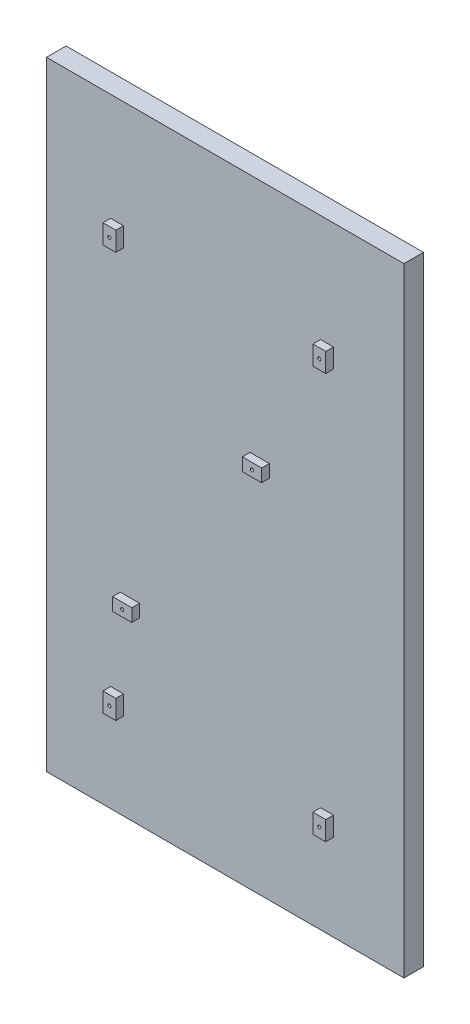
ISO-10303-21;
HEADER;
FILE_DESCRIPTION(('STEP AP214'),'2;1');
FILE_NAME('part.step','',(''),(''),'','','');
FILE_SCHEMA(('AUTOMOTIVE_DESIGN { 1 0 10303 214 1 1 1 1 }'));
ENDSEC;
DATA;
#1=APPLICATION_CONTEXT('core data for automotive mechanical design processes');
#2=APPLICATION_PROTOCOL_DEFINITION('international standard','automotive_design',2000,#1);
#3=PRODUCT_CONTEXT('',#1,'mechanical');
#4=PRODUCT('Part','Part','',(#3));
#5=PRODUCT_RELATED_PRODUCT_CATEGORY('part','',(#4));
#6=PRODUCT_DEFINITION_FORMATION('','',#4);
#7=PRODUCT_DEFINITION_CONTEXT('part definition',#1,'design');
#8=PRODUCT_DEFINITION('design','',#6,#7);
#9=PRODUCT_DEFINITION_SHAPE('','',#8);
#10=(LENGTH_UNIT() NAMED_UNIT(*) SI_UNIT(.MILLI.,.METRE.));
#11=(NAMED_UNIT(*) PLANE_ANGLE_UNIT() SI_UNIT($,.RADIAN.));
#12=(NAMED_UNIT(*) SI_UNIT($,.STERADIAN.) SOLID_ANGLE_UNIT());
#13=UNCERTAINTY_MEASURE_WITH_UNIT(LENGTH_MEASURE(1.E-05),#10,'distance_accuracy_value','');
#14=(GEOMETRIC_REPRESENTATION_CONTEXT(3) GLOBAL_UNCERTAINTY_ASSIGNED_CONTEXT((#13)) GLOBAL_UNIT_ASSIGNED_CONTEXT((#10,
#11,#12)) REPRESENTATION_CONTEXT('',''));
#15=CARTESIAN_POINT('',(0.,0.,0.));
#16=DIRECTION('',(0.,0.,1.));
#17=DIRECTION('',(1.,0.,0.));
#18=AXIS2_PLACEMENT_3D('',#15,#16,#17);
#19=CARTESIAN_POINT('',(111.5,0.,6.1));
#20=DIRECTION('',(0.,1.,0.));
#21=DIRECTION('',(0.,0.,1.));
#22=AXIS2_PLACEMENT_3D('',#19,#20,#21);
#23=PLANE('',#22);
#24=DIRECTION('',(1.,0.,0.));
#25=VECTOR('',#24,1.);
#26=CARTESIAN_POINT('',(111.5,0.,0.));
#27=LINE('',#26,#25);
#28=CARTESIAN_POINT('',(0.,0.,0.));
#29=VERTEX_POINT('',#28);
#30=CARTESIAN_POINT('',(111.5,0.,0.));
#31=VERTEX_POINT('',#30);
#32=EDGE_CURVE('E438',#29,#31,#27,.T.);
#33=ORIENTED_EDGE('',*,*,#32,.T.);
#34=DIRECTION('',(0.,0.,-1.));
#35=VECTOR('',#34,1.);
#36=CARTESIAN_POINT('',(111.5,0.,6.1));
#37=LINE('',#36,#35);
#38=CARTESIAN_POINT('',(111.5,0.,6.1));
#39=VERTEX_POINT('',#38);
#40=EDGE_CURVE('E11',#39,#31,#37,.T.);
#41=ORIENTED_EDGE('',*,*,#40,.F.);
#42=DIRECTION('',(1.,0.,0.));
#43=VECTOR('',#42,1.);
#44=CARTESIAN_POINT('',(111.5,0.,6.1));
#45=LINE('',#44,#43);
#46=CARTESIAN_POINT('',(0.,0.,6.1));
#47=VERTEX_POINT('',#46);
#48=EDGE_CURVE('E439',#47,#39,#45,.T.);
#49=ORIENTED_EDGE('',*,*,#48,.F.);
#50=DIRECTION('',(0.,0.,-1.));
#51=VECTOR('',#50,1.);
#52=CARTESIAN_POINT('',(0.,0.,6.1));
#53=LINE('',#52,#51);
#54=EDGE_CURVE('E449',#47,#29,#53,.T.);
#55=ORIENTED_EDGE('',*,*,#54,.T.);
#56=EDGE_LOOP('',(#33,#41,#49,#55));
#57=FACE_BOUND('',#56,.T.);
#58=ADVANCED_FACE('F33',(#57),#23,.F.);
#59=CARTESIAN_POINT('',(111.5,193.,6.1));
#60=DIRECTION('',(-1.,0.,0.));
#61=DIRECTION('',(0.,0.,1.));
#62=AXIS2_PLACEMENT_3D('',#59,#60,#61);
#63=PLANE('',#62);
#64=DIRECTION('',(0.,1.,0.));
#65=VECTOR('',#64,1.);
#66=CARTESIAN_POINT('',(111.5,193.,0.));
#67=LINE('',#66,#65);
#68=CARTESIAN_POINT('',(111.5,193.,0.));
#69=VERTEX_POINT('',#68);
#70=EDGE_CURVE('E452',#31,#69,#67,.T.);
#71=ORIENTED_EDGE('',*,*,#70,.T.);
#72=DIRECTION('',(0.,0.,-1.));
#73=VECTOR('',#72,1.);
#74=CARTESIAN_POINT('',(111.5,193.,6.1));
#75=LINE('',#74,#73);
#76=CARTESIAN_POINT('',(111.5,193.,6.1));
#77=VERTEX_POINT('',#76);
#78=EDGE_CURVE('E40',#77,#69,#75,.T.);
#79=ORIENTED_EDGE('',*,*,#78,.F.);
#80=DIRECTION('',(0.,1.,0.));
#81=VECTOR('',#80,1.);
#82=CARTESIAN_POINT('',(111.5,193.,6.1));
#83=LINE('',#82,#81);
#84=EDGE_CURVE('E442',#39,#77,#83,.T.);
#85=ORIENTED_EDGE('',*,*,#84,.F.);
#86=ORIENTED_EDGE('',*,*,#40,.T.);
#87=EDGE_LOOP('',(#71,#79,#85,#86));
#88=FACE_BOUND('',#87,.T.);
#89=ADVANCED_FACE('F482',(#88),#63,.F.);
#90=CARTESIAN_POINT('',(0.,193.,6.1));
#91=DIRECTION('',(0.,-1.,0.));
#92=DIRECTION('',(0.,0.,-1.));
#93=AXIS2_PLACEMENT_3D('',#90,#91,#92);
#94=PLANE('',#93);
#95=DIRECTION('',(-1.,0.,0.));
#96=VECTOR('',#95,1.);
#97=CARTESIAN_POINT('',(0.,193.,0.));
#98=LINE('',#97,#96);
#99=CARTESIAN_POINT('',(0.,193.,0.));
#100=VERTEX_POINT('',#99);
#101=EDGE_CURVE('E454',#69,#100,#98,.T.);
#102=ORIENTED_EDGE('',*,*,#101,.T.);
#103=DIRECTION('',(0.,0.,-1.));
#104=VECTOR('',#103,1.);
#105=CARTESIAN_POINT('',(0.,193.,6.1));
#106=LINE('',#105,#104);
#107=CARTESIAN_POINT('',(0.,193.,6.1));
#108=VERTEX_POINT('',#107);
#109=EDGE_CURVE('E459',#108,#100,#106,.T.);
#110=ORIENTED_EDGE('',*,*,#109,.F.);
#111=DIRECTION('',(-1.,0.,0.));
#112=VECTOR('',#111,1.);
#113=CARTESIAN_POINT('',(0.,193.,6.1));
#114=LINE('',#113,#112);
#115=EDGE_CURVE('E445',#77,#108,#114,.T.);
#116=ORIENTED_EDGE('',*,*,#115,.F.);
#117=ORIENTED_EDGE('',*,*,#78,.T.);
#118=EDGE_LOOP('',(#102,#110,#116,#117));
#119=FACE_BOUND('',#118,.T.);
#120=ADVANCED_FACE('F466',(#119),#94,.F.);
#121=CARTESIAN_POINT('',(0.,0.,6.1));
#122=DIRECTION('',(1.,0.,0.));
#123=DIRECTION('',(0.,0.,-1.));
#124=AXIS2_PLACEMENT_3D('',#121,#122,#123);
#125=PLANE('',#124);
#126=DIRECTION('',(0.,-1.,0.));
#127=VECTOR('',#126,1.);
#128=CARTESIAN_POINT('',(0.,0.,0.));
#129=LINE('',#128,#127);
#130=EDGE_CURVE('E443',#100,#29,#129,.T.);
#131=ORIENTED_EDGE('',*,*,#130,.T.);
#132=ORIENTED_EDGE('',*,*,#54,.F.);
#133=DIRECTION('',(0.,-1.,0.));
#134=VECTOR('',#133,1.);
#135=CARTESIAN_POINT('',(0.,0.,6.1));
#136=LINE('',#135,#134);
#137=EDGE_CURVE('E447',#108,#47,#136,.T.);
#138=ORIENTED_EDGE('',*,*,#137,.F.);
#139=ORIENTED_EDGE('',*,*,#109,.T.);
#140=EDGE_LOOP('',(#131,#132,#138,#139));
#141=FACE_BOUND('',#140,.T.);
#142=ADVANCED_FACE('F475',(#141),#125,.F.);
#143=CARTESIAN_POINT('',(0.,0.,6.1));
#144=DIRECTION('',(0.,0.,-1.));
#145=DIRECTION('',(-1.,0.,0.));
#146=AXIS2_PLACEMENT_3D('',#143,#144,#145);
#147=PLANE('',#146);
#148=DIRECTION('',(0.,-1.,0.));
#149=VECTOR('',#148,1.);
#150=CARTESIAN_POINT('',(23.,60.,6.1));
#151=LINE('',#150,#149);
#152=CARTESIAN_POINT('',(23.,60.,6.1));
#153=VERTEX_POINT('',#152);
#154=CARTESIAN_POINT('',(23.,56.,6.1));
#155=VERTEX_POINT('',#154);
#156=EDGE_CURVE('E238',#153,#155,#151,.T.);
#157=ORIENTED_EDGE('',*,*,#156,.F.);
#158=DIRECTION('',(-1.,0.,0.));
#159=VECTOR('',#158,1.);
#160=CARTESIAN_POINT('',(23.,60.,6.1));
#161=LINE('',#160,#159);
#162=CARTESIAN_POINT('',(29.,60.,6.1));
#163=VERTEX_POINT('',#162);
#164=EDGE_CURVE('E235',#163,#153,#161,.T.);
#165=ORIENTED_EDGE('',*,*,#164,.F.);
#166=DIRECTION('',(0.,1.,0.));
#167=VECTOR('',#166,1.);
#168=CARTESIAN_POINT('',(29.,60.,6.1));
#169=LINE('',#168,#167);
#170=CARTESIAN_POINT('',(29.,56.,6.1));
#171=VERTEX_POINT('',#170);
#172=EDGE_CURVE('E52',#171,#163,#169,.T.);
#173=ORIENTED_EDGE('',*,*,#172,.F.);
#174=DIRECTION('',(1.,0.,0.));
#175=VECTOR('',#174,1.);
#176=CARTESIAN_POINT('',(23.,56.,6.1));
#177=LINE('',#176,#175);
#178=EDGE_CURVE('E47',#155,#171,#177,.T.);
#179=ORIENTED_EDGE('',*,*,#178,.F.);
#180=EDGE_LOOP('',(#157,#165,#173,#179));
#181=FACE_BOUND('',#180,.T.);
#182=DIRECTION('',(0.,-1.,0.));
#183=VECTOR('',#182,1.);
#184=CARTESIAN_POINT('',(63.5,118.,6.1));
#185=LINE('',#184,#183);
#186=CARTESIAN_POINT('',(63.5,118.,6.1));
#187=VERTEX_POINT('',#186);
#188=CARTESIAN_POINT('',(63.5,114.,6.1));
#189=VERTEX_POINT('',#188);
#190=EDGE_CURVE('E249',#187,#189,#185,.T.);
#191=ORIENTED_EDGE('',*,*,#190,.F.);
#192=DIRECTION('',(-1.,0.,0.));
#193=VECTOR('',#192,1.);
#194=CARTESIAN_POINT('',(63.5,118.,6.1));
#195=LINE('',#194,#193);
#196=CARTESIAN_POINT('',(69.5,118.,6.1));
#197=VERTEX_POINT('',#196);
#198=EDGE_CURVE('E255',#197,#187,#195,.T.);
#199=ORIENTED_EDGE('',*,*,#198,.F.);
#200=DIRECTION('',(0.,1.,0.));
#201=VECTOR('',#200,1.);
#202=CARTESIAN_POINT('',(69.5,118.,6.1));
#203=LINE('',#202,#201);
#204=CARTESIAN_POINT('',(69.5,114.,6.1));
#205=VERTEX_POINT('',#204);
#206=EDGE_CURVE('E267',#205,#197,#203,.T.);
#207=ORIENTED_EDGE('',*,*,#206,.F.);
#208=DIRECTION('',(1.,0.,0.));
#209=VECTOR('',#208,1.);
#210=CARTESIAN_POINT('',(63.5,114.,6.1));
#211=LINE('',#210,#209);
#212=EDGE_CURVE('E264',#189,#205,#211,.T.);
#213=ORIENTED_EDGE('',*,*,#212,.F.);
#214=EDGE_LOOP('',(#191,#199,#207,#213));
#215=FACE_BOUND('',#214,.T.);
#216=DIRECTION('',(0.,-1.,0.));
#217=VECTOR('',#216,1.);
#218=CARTESIAN_POINT('',(85.5,159.5,6.1));
#219=LINE('',#218,#217);
#220=CARTESIAN_POINT('',(85.5,159.5,6.1));
#221=VERTEX_POINT('',#220);
#222=CARTESIAN_POINT('',(85.5,153.5,6.1));
#223=VERTEX_POINT('',#222);
#224=EDGE_CURVE('E287',#221,#223,#219,.T.);
#225=ORIENTED_EDGE('',*,*,#224,.F.);
#226=DIRECTION('',(-1.,0.,0.));
#227=VECTOR('',#226,1.);
#228=CARTESIAN_POINT('',(85.5,159.5,6.1));
#229=LINE('',#228,#227);
#230=CARTESIAN_POINT('',(89.5,159.5,6.1));
#231=VERTEX_POINT('',#230);
#232=EDGE_CURVE('E294',#231,#221,#229,.T.);
#233=ORIENTED_EDGE('',*,*,#232,.F.);
#234=DIRECTION('',(0.,1.,0.));
#235=VECTOR('',#234,1.);
#236=CARTESIAN_POINT('',(89.5,159.5,6.1));
#237=LINE('',#236,#235);
#238=CARTESIAN_POINT('',(89.5,153.5,6.1));
#239=VERTEX_POINT('',#238);
#240=EDGE_CURVE('E306',#239,#231,#237,.T.);
#241=ORIENTED_EDGE('',*,*,#240,.F.);
#242=DIRECTION('',(1.,0.,0.));
#243=VECTOR('',#242,1.);
#244=CARTESIAN_POINT('',(85.5,153.5,6.1));
#245=LINE('',#244,#243);
#246=EDGE_CURVE('E303',#223,#239,#245,.T.);
#247=ORIENTED_EDGE('',*,*,#246,.F.);
#248=EDGE_LOOP('',(#225,#233,#241,#247));
#249=FACE_BOUND('',#248,.T.);
#250=DIRECTION('',(0.,-1.,0.));
#251=VECTOR('',#250,1.);
#252=CARTESIAN_POINT('',(20.,159.5,6.1));
#253=LINE('',#252,#251);
#254=CARTESIAN_POINT('',(20.,159.5,6.1));
#255=VERTEX_POINT('',#254);
#256=CARTESIAN_POINT('',(20.,153.5,6.1));
#257=VERTEX_POINT('',#256);
#258=EDGE_CURVE('E326',#255,#257,#253,.T.);
#259=ORIENTED_EDGE('',*,*,#258,.F.);
#260=DIRECTION('',(-1.,0.,0.));
#261=VECTOR('',#260,1.);
#262=CARTESIAN_POINT('',(20.,159.5,6.1));
#263=LINE('',#262,#261);
#264=CARTESIAN_POINT('',(24.,159.5,6.1));
#265=VERTEX_POINT('',#264);
#266=EDGE_CURVE('E333',#265,#255,#263,.T.);
#267=ORIENTED_EDGE('',*,*,#266,.F.);
#268=DIRECTION('',(0.,1.,0.));
#269=VECTOR('',#268,1.);
#270=CARTESIAN_POINT('',(24.,159.5,6.1));
#271=LINE('',#270,#269);
#272=CARTESIAN_POINT('',(24.,153.5,6.1));
#273=VERTEX_POINT('',#272);
#274=EDGE_CURVE('E345',#273,#265,#271,.T.);
#275=ORIENTED_EDGE('',*,*,#274,.F.);
#276=DIRECTION('',(1.,0.,0.));
#277=VECTOR('',#276,1.);
#278=CARTESIAN_POINT('',(20.,153.5,6.1));
#279=LINE('',#278,#277);
#280=EDGE_CURVE('E342',#257,#273,#279,.T.);
#281=ORIENTED_EDGE('',*,*,#280,.F.);
#282=EDGE_LOOP('',(#259,#267,#275,#281));
#283=FACE_BOUND('',#282,.T.);
#284=DIRECTION('',(0.,-1.,0.));
#285=VECTOR('',#284,1.);
#286=CARTESIAN_POINT('',(20.,33.,6.1));
#287=LINE('',#286,#285);
#288=CARTESIAN_POINT('',(20.,33.,6.1));
#289=VERTEX_POINT('',#288);
#290=CARTESIAN_POINT('',(20.,27.,6.1));
#291=VERTEX_POINT('',#290);
#292=EDGE_CURVE('E365',#289,#291,#287,.T.);
#293=ORIENTED_EDGE('',*,*,#292,.F.);
#294=DIRECTION('',(-1.,0.,0.));
#295=VECTOR('',#294,1.);
#296=CARTESIAN_POINT('',(20.,33.,6.1));
#297=LINE('',#296,#295);
#298=CARTESIAN_POINT('',(24.,33.,6.1));
#299=VERTEX_POINT('',#298);
#300=EDGE_CURVE('E372',#299,#289,#297,.T.);
#301=ORIENTED_EDGE('',*,*,#300,.F.);
#302=DIRECTION('',(0.,1.,0.));
#303=VECTOR('',#302,1.);
#304=CARTESIAN_POINT('',(24.,33.,6.1));
#305=LINE('',#304,#303);
#306=CARTESIAN_POINT('',(24.,27.,6.1));
#307=VERTEX_POINT('',#306);
#308=EDGE_CURVE('E384',#307,#299,#305,.T.);
#309=ORIENTED_EDGE('',*,*,#308,.F.);
#310=DIRECTION('',(1.,0.,0.));
#311=VECTOR('',#310,1.);
#312=CARTESIAN_POINT('',(20.,27.,6.1));
#313=LINE('',#312,#311);
#314=EDGE_CURVE('E381',#291,#307,#313,.T.);
#315=ORIENTED_EDGE('',*,*,#314,.F.);
#316=EDGE_LOOP('',(#293,#301,#309,#315));
#317=FACE_BOUND('',#316,.T.);
#318=DIRECTION('',(-1.,0.,0.));
#319=VECTOR('',#318,1.);
#320=CARTESIAN_POINT('',(87.5,33.,6.1));
#321=LINE('',#320,#319);
#322=CARTESIAN_POINT('',(89.5,33.,6.1));
#323=VERTEX_POINT('',#322);
#324=CARTESIAN_POINT('',(85.5,33.,6.1));
#325=VERTEX_POINT('',#324);
#326=EDGE_CURVE('E404',#323,#325,#321,.T.);
#327=ORIENTED_EDGE('',*,*,#326,.F.);
#328=DIRECTION('',(0.,1.,0.));
#329=VECTOR('',#328,1.);
#330=CARTESIAN_POINT('',(89.5,27.,6.1));
#331=LINE('',#330,#329);
#332=CARTESIAN_POINT('',(89.5,27.,6.1));
#333=VERTEX_POINT('',#332);
#334=EDGE_CURVE('E410',#333,#323,#331,.T.);
#335=ORIENTED_EDGE('',*,*,#334,.F.);
#336=DIRECTION('',(1.,0.,0.));
#337=VECTOR('',#336,1.);
#338=CARTESIAN_POINT('',(85.5,27.,6.1));
#339=LINE('',#338,#337);
#340=CARTESIAN_POINT('',(85.5,27.,6.1));
#341=VERTEX_POINT('',#340);
#342=EDGE_CURVE('E422',#341,#333,#339,.T.);
#343=ORIENTED_EDGE('',*,*,#342,.F.);
#344=DIRECTION('',(0.,-1.,0.));
#345=VECTOR('',#344,1.);
#346=CARTESIAN_POINT('',(85.5,33.,6.1));
#347=LINE('',#346,#345);
#348=EDGE_CURVE('E419',#325,#341,#347,.T.);
#349=ORIENTED_EDGE('',*,*,#348,.F.);
#350=EDGE_LOOP('',(#327,#335,#343,#349));
#351=FACE_BOUND('',#350,.T.);
#352=ORIENTED_EDGE('',*,*,#48,.T.);
#353=ORIENTED_EDGE('',*,*,#84,.T.);
#354=ORIENTED_EDGE('',*,*,#115,.T.);
#355=ORIENTED_EDGE('',*,*,#137,.T.);
#356=EDGE_LOOP('',(#352,#353,#354,#355));
#357=FACE_BOUND('',#356,.T.);
#358=ADVANCED_FACE('F481',(#181,#215,#249,#283,#317,#351,#357),#147,.F.);
#359=CARTESIAN_POINT('',(0.,0.,0.));
#360=DIRECTION('',(0.,0.,-1.));
#361=DIRECTION('',(-1.,0.,0.));
#362=AXIS2_PLACEMENT_3D('',#359,#360,#361);
#363=PLANE('',#362);
#364=ORIENTED_EDGE('',*,*,#32,.F.);
#365=ORIENTED_EDGE('',*,*,#130,.F.);
#366=ORIENTED_EDGE('',*,*,#101,.F.);
#367=ORIENTED_EDGE('',*,*,#70,.F.);
#368=EDGE_LOOP('',(#364,#365,#366,#367));
#369=FACE_BOUND('',#368,.T.);
#370=ADVANCED_FACE('F472',(#369),#363,.T.);
#371=CARTESIAN_POINT('',(0.,0.,8.5));
#372=DIRECTION('',(0.,0.,1.));
#373=DIRECTION('',(1.,0.,0.));
#374=AXIS2_PLACEMENT_3D('',#371,#372,#373);
#375=PLANE('',#374);
#376=DIRECTION('',(-1.,0.,0.));
#377=VECTOR('',#376,1.);
#378=CARTESIAN_POINT('',(89.5,33.,8.5));
#379=LINE('',#378,#377);
#380=CARTESIAN_POINT('',(89.5,33.,8.5));
#381=VERTEX_POINT('',#380);
#382=CARTESIAN_POINT('',(85.5,33.,8.5));
#383=VERTEX_POINT('',#382);
#384=EDGE_CURVE('E407',#381,#383,#379,.T.);
#385=ORIENTED_EDGE('',*,*,#384,.T.);
#386=DIRECTION('',(0.,-1.,0.));
#387=VECTOR('',#386,1.);
#388=CARTESIAN_POINT('',(85.5,33.,8.5));
#389=LINE('',#388,#387);
#390=CARTESIAN_POINT('',(85.5,27.,8.5));
#391=VERTEX_POINT('',#390);
#392=EDGE_CURVE('E409',#383,#391,#389,.T.);
#393=ORIENTED_EDGE('',*,*,#392,.T.);
#394=DIRECTION('',(1.,0.,0.));
#395=VECTOR('',#394,1.);
#396=CARTESIAN_POINT('',(85.5,27.,8.5));
#397=LINE('',#396,#395);
#398=CARTESIAN_POINT('',(89.5,27.,8.5));
#399=VERTEX_POINT('',#398);
#400=EDGE_CURVE('E412',#391,#399,#397,.T.);
#401=ORIENTED_EDGE('',*,*,#400,.T.);
#402=DIRECTION('',(0.,1.,0.));
#403=VECTOR('',#402,1.);
#404=CARTESIAN_POINT('',(89.5,27.,8.5));
#405=LINE('',#404,#403);
#406=EDGE_CURVE('E414',#399,#381,#405,.T.);
#407=ORIENTED_EDGE('',*,*,#406,.T.);
#408=EDGE_LOOP('',(#385,#393,#401,#407));
#409=FACE_BOUND('',#408,.T.);
#410=CARTESIAN_POINT('',(87.5,30.,8.5));
#411=DIRECTION('',(0.,0.,1.));
#412=DIRECTION('',(1.,0.,0.));
#413=AXIS2_PLACEMENT_3D('',#410,#411,#412);
#414=CIRCLE('',#413,0.499999999999999);
#415=CARTESIAN_POINT('',(88.,30.,8.5));
#416=VERTEX_POINT('',#415);
#417=EDGE_CURVE('E401',#416,#416,#414,.T.);
#418=ORIENTED_EDGE('',*,*,#417,.F.);
#419=EDGE_LOOP('',(#418));
#420=FACE_BOUND('',#419,.T.);
#421=ADVANCED_FACE('F494',(#409,#420),#375,.T.);
#422=CARTESIAN_POINT('',(87.5,33.,8.5));
#423=DIRECTION('',(0.,-1.,0.));
#424=DIRECTION('',(0.,0.,-1.));
#425=AXIS2_PLACEMENT_3D('',#422,#423,#424);
#426=PLANE('',#425);
#427=ORIENTED_EDGE('',*,*,#326,.T.);
#428=DIRECTION('',(0.,0.,-1.));
#429=VECTOR('',#428,1.);
#430=CARTESIAN_POINT('',(85.5,33.,8.5));
#431=LINE('',#430,#429);
#432=EDGE_CURVE('E435',#383,#325,#431,.T.);
#433=ORIENTED_EDGE('',*,*,#432,.F.);
#434=ORIENTED_EDGE('',*,*,#384,.F.);
#435=DIRECTION('',(0.,0.,-1.));
#436=VECTOR('',#435,1.);
#437=CARTESIAN_POINT('',(89.5,33.,8.5));
#438=LINE('',#437,#436);
#439=EDGE_CURVE('E416',#381,#323,#438,.T.);
#440=ORIENTED_EDGE('',*,*,#439,.T.);
#441=EDGE_LOOP('',(#427,#433,#434,#440));
#442=FACE_BOUND('',#441,.T.);
#443=ADVANCED_FACE('F499',(#442),#426,.F.);
#444=CARTESIAN_POINT('',(85.5,33.,8.5));
#445=DIRECTION('',(1.,0.,0.));
#446=DIRECTION('',(0.,0.,-1.));
#447=AXIS2_PLACEMENT_3D('',#444,#445,#446);
#448=PLANE('',#447);
#449=ORIENTED_EDGE('',*,*,#348,.T.);
#450=DIRECTION('',(0.,0.,-1.));
#451=VECTOR('',#450,1.);
#452=CARTESIAN_POINT('',(85.5,27.,8.5));
#453=LINE('',#452,#451);
#454=EDGE_CURVE('E432',#391,#341,#453,.T.);
#455=ORIENTED_EDGE('',*,*,#454,.F.);
#456=ORIENTED_EDGE('',*,*,#392,.F.);
#457=ORIENTED_EDGE('',*,*,#432,.T.);
#458=EDGE_LOOP('',(#449,#455,#456,#457));
#459=FACE_BOUND('',#458,.T.);
#460=ADVANCED_FACE('F502',(#459),#448,.F.);
#461=CARTESIAN_POINT('',(85.5,27.,8.5));
#462=DIRECTION('',(0.,1.,0.));
#463=DIRECTION('',(0.,0.,1.));
#464=AXIS2_PLACEMENT_3D('',#461,#462,#463);
#465=PLANE('',#464);
#466=ORIENTED_EDGE('',*,*,#342,.T.);
#467=DIRECTION('',(0.,0.,-1.));
#468=VECTOR('',#467,1.);
#469=CARTESIAN_POINT('',(89.5,27.,8.5));
#470=LINE('',#469,#468);
#471=EDGE_CURVE('E429',#399,#333,#470,.T.);
#472=ORIENTED_EDGE('',*,*,#471,.F.);
#473=ORIENTED_EDGE('',*,*,#400,.F.);
#474=ORIENTED_EDGE('',*,*,#454,.T.);
#475=EDGE_LOOP('',(#466,#472,#473,#474));
#476=FACE_BOUND('',#475,.T.);
#477=ADVANCED_FACE('F506',(#476),#465,.F.);
#478=CARTESIAN_POINT('',(89.5,27.,8.5));
#479=DIRECTION('',(-1.,0.,0.));
#480=DIRECTION('',(0.,0.,1.));
#481=AXIS2_PLACEMENT_3D('',#478,#479,#480);
#482=PLANE('',#481);
#483=ORIENTED_EDGE('',*,*,#334,.T.);
#484=ORIENTED_EDGE('',*,*,#439,.F.);
#485=ORIENTED_EDGE('',*,*,#406,.F.);
#486=ORIENTED_EDGE('',*,*,#471,.T.);
#487=EDGE_LOOP('',(#483,#484,#485,#486));
#488=FACE_BOUND('',#487,.T.);
#489=ADVANCED_FACE('F510',(#488),#482,.F.);
#490=CARTESIAN_POINT('',(87.5,30.,8.5));
#491=DIRECTION('',(0.,0.,-1.));
#492=DIRECTION('',(-1.,0.,0.));
#493=AXIS2_PLACEMENT_3D('',#490,#491,#492);
#494=CYLINDRICAL_SURFACE('',#493,0.499999999999999);
#495=ORIENTED_EDGE('',*,*,#417,.T.);
#496=EDGE_LOOP('',(#495));
#497=FACE_BOUND('',#496,.T.);
#498=CARTESIAN_POINT('',(87.5,30.,6.1));
#499=DIRECTION('',(0.,0.,1.));
#500=DIRECTION('',(1.,0.,0.));
#501=AXIS2_PLACEMENT_3D('',#498,#499,#500);
#502=CIRCLE('',#501,0.499999999999999);
#503=CARTESIAN_POINT('',(88.,30.,6.1));
#504=VERTEX_POINT('',#503);
#505=EDGE_CURVE('E400',#504,#504,#502,.T.);
#506=ORIENTED_EDGE('',*,*,#505,.F.);
#507=EDGE_LOOP('',(#506));
#508=FACE_BOUND('',#507,.T.);
#509=ADVANCED_FACE('F514',(#497,#508),#494,.F.);
#510=ORIENTED_EDGE('',*,*,#505,.T.);
#511=EDGE_LOOP('',(#510));
#512=FACE_BOUND('',#511,.T.);
#513=ADVANCED_FACE('F498',(#512),#147,.F.);
#514=CARTESIAN_POINT('',(0.,0.,8.5));
#515=DIRECTION('',(0.,0.,1.));
#516=DIRECTION('',(1.,0.,0.));
#517=AXIS2_PLACEMENT_3D('',#514,#515,#516);
#518=PLANE('',#517);
#519=DIRECTION('',(0.,-1.,0.));
#520=VECTOR('',#519,1.);
#521=CARTESIAN_POINT('',(20.,33.,8.5));
#522=LINE('',#521,#520);
#523=CARTESIAN_POINT('',(20.,33.,8.5));
#524=VERTEX_POINT('',#523);
#525=CARTESIAN_POINT('',(20.,27.,8.5));
#526=VERTEX_POINT('',#525);
#527=EDGE_CURVE('E368',#524,#526,#522,.T.);
#528=ORIENTED_EDGE('',*,*,#527,.T.);
#529=DIRECTION('',(1.,0.,0.));
#530=VECTOR('',#529,1.);
#531=CARTESIAN_POINT('',(20.,27.,8.5));
#532=LINE('',#531,#530);
#533=CARTESIAN_POINT('',(24.,27.,8.5));
#534=VERTEX_POINT('',#533);
#535=EDGE_CURVE('E371',#526,#534,#532,.T.);
#536=ORIENTED_EDGE('',*,*,#535,.T.);
#537=DIRECTION('',(0.,1.,0.));
#538=VECTOR('',#537,1.);
#539=CARTESIAN_POINT('',(24.,33.,8.5));
#540=LINE('',#539,#538);
#541=CARTESIAN_POINT('',(24.,33.,8.5));
#542=VERTEX_POINT('',#541);
#543=EDGE_CURVE('E374',#534,#542,#540,.T.);
#544=ORIENTED_EDGE('',*,*,#543,.T.);
#545=DIRECTION('',(-1.,0.,0.));
#546=VECTOR('',#545,1.);
#547=CARTESIAN_POINT('',(20.,33.,8.5));
#548=LINE('',#547,#546);
#549=EDGE_CURVE('E376',#542,#524,#548,.T.);
#550=ORIENTED_EDGE('',*,*,#549,.T.);
#551=EDGE_LOOP('',(#528,#536,#544,#550));
#552=FACE_BOUND('',#551,.T.);
#553=CARTESIAN_POINT('',(22.,30.,8.5));
#554=DIRECTION('',(0.,0.,1.));
#555=DIRECTION('',(1.,0.,0.));
#556=AXIS2_PLACEMENT_3D('',#553,#554,#555);
#557=CIRCLE('',#556,0.499999999999999);
#558=CARTESIAN_POINT('',(22.5,30.,8.5));
#559=VERTEX_POINT('',#558);
#560=EDGE_CURVE('E362',#559,#559,#557,.T.);
#561=ORIENTED_EDGE('',*,*,#560,.F.);
#562=EDGE_LOOP('',(#561));
#563=FACE_BOUND('',#562,.T.);
#564=ADVANCED_FACE('F526',(#552,#563),#518,.T.);
#565=CARTESIAN_POINT('',(20.,33.,8.5));
#566=DIRECTION('',(1.,0.,0.));
#567=DIRECTION('',(0.,0.,-1.));
#568=AXIS2_PLACEMENT_3D('',#565,#566,#567);
#569=PLANE('',#568);
#570=ORIENTED_EDGE('',*,*,#292,.T.);
#571=DIRECTION('',(0.,0.,-1.));
#572=VECTOR('',#571,1.);
#573=CARTESIAN_POINT('',(20.,27.,8.5));
#574=LINE('',#573,#572);
#575=EDGE_CURVE('E397',#526,#291,#574,.T.);
#576=ORIENTED_EDGE('',*,*,#575,.F.);
#577=ORIENTED_EDGE('',*,*,#527,.F.);
#578=DIRECTION('',(0.,0.,-1.));
#579=VECTOR('',#578,1.);
#580=CARTESIAN_POINT('',(20.,33.,8.5));
#581=LINE('',#580,#579);
#582=EDGE_CURVE('E378',#524,#289,#581,.T.);
#583=ORIENTED_EDGE('',*,*,#582,.T.);
#584=EDGE_LOOP('',(#570,#576,#577,#583));
#585=FACE_BOUND('',#584,.T.);
#586=ADVANCED_FACE('F522',(#585),#569,.F.);
#587=CARTESIAN_POINT('',(20.,27.,8.5));
#588=DIRECTION('',(0.,1.,0.));
#589=DIRECTION('',(0.,0.,1.));
#590=AXIS2_PLACEMENT_3D('',#587,#588,#589);
#591=PLANE('',#590);
#592=ORIENTED_EDGE('',*,*,#314,.T.);
#593=DIRECTION('',(0.,0.,-1.));
#594=VECTOR('',#593,1.);
#595=CARTESIAN_POINT('',(24.,27.,8.5));
#596=LINE('',#595,#594);
#597=EDGE_CURVE('E394',#534,#307,#596,.T.);
#598=ORIENTED_EDGE('',*,*,#597,.F.);
#599=ORIENTED_EDGE('',*,*,#535,.F.);
#600=ORIENTED_EDGE('',*,*,#575,.T.);
#601=EDGE_LOOP('',(#592,#598,#599,#600));
#602=FACE_BOUND('',#601,.T.);
#603=ADVANCED_FACE('F525',(#602),#591,.F.);
#604=CARTESIAN_POINT('',(24.,33.,8.5));
#605=DIRECTION('',(-1.,0.,0.));
#606=DIRECTION('',(0.,0.,1.));
#607=AXIS2_PLACEMENT_3D('',#604,#605,#606);
#608=PLANE('',#607);
#609=ORIENTED_EDGE('',*,*,#308,.T.);
#610=DIRECTION('',(0.,0.,-1.));
#611=VECTOR('',#610,1.);
#612=CARTESIAN_POINT('',(24.,33.,8.5));
#613=LINE('',#612,#611);
#614=EDGE_CURVE('E391',#542,#299,#613,.T.);
#615=ORIENTED_EDGE('',*,*,#614,.F.);
#616=ORIENTED_EDGE('',*,*,#543,.F.);
#617=ORIENTED_EDGE('',*,*,#597,.T.);
#618=EDGE_LOOP('',(#609,#615,#616,#617));
#619=FACE_BOUND('',#618,.T.);
#620=ADVANCED_FACE('F530',(#619),#608,.F.);
#621=CARTESIAN_POINT('',(20.,33.,8.5));
#622=DIRECTION('',(0.,-1.,0.));
#623=DIRECTION('',(0.,0.,-1.));
#624=AXIS2_PLACEMENT_3D('',#621,#622,#623);
#625=PLANE('',#624);
#626=ORIENTED_EDGE('',*,*,#300,.T.);
#627=ORIENTED_EDGE('',*,*,#582,.F.);
#628=ORIENTED_EDGE('',*,*,#549,.F.);
#629=ORIENTED_EDGE('',*,*,#614,.T.);
#630=EDGE_LOOP('',(#626,#627,#628,#629));
#631=FACE_BOUND('',#630,.T.);
#632=ADVANCED_FACE('F534',(#631),#625,.F.);
#633=CARTESIAN_POINT('',(22.,30.,8.5));
#634=DIRECTION('',(0.,0.,-1.));
#635=DIRECTION('',(-1.,0.,0.));
#636=AXIS2_PLACEMENT_3D('',#633,#634,#635);
#637=CYLINDRICAL_SURFACE('',#636,0.499999999999999);
#638=ORIENTED_EDGE('',*,*,#560,.T.);
#639=EDGE_LOOP('',(#638));
#640=FACE_BOUND('',#639,.T.);
#641=CARTESIAN_POINT('',(22.,30.,6.1));
#642=DIRECTION('',(0.,0.,1.));
#643=DIRECTION('',(1.,0.,0.));
#644=AXIS2_PLACEMENT_3D('',#641,#642,#643);
#645=CIRCLE('',#644,0.499999999999999);
#646=CARTESIAN_POINT('',(22.5,30.,6.1));
#647=VERTEX_POINT('',#646);
#648=EDGE_CURVE('E361',#647,#647,#645,.T.);
#649=ORIENTED_EDGE('',*,*,#648,.F.);
#650=EDGE_LOOP('',(#649));
#651=FACE_BOUND('',#650,.T.);
#652=ADVANCED_FACE('F538',(#640,#651),#637,.F.);
#653=ORIENTED_EDGE('',*,*,#648,.T.);
#654=EDGE_LOOP('',(#653));
#655=FACE_BOUND('',#654,.T.);
#656=ADVANCED_FACE('F545',(#655),#147,.F.);
#657=CARTESIAN_POINT('',(0.,0.,8.5));
#658=DIRECTION('',(0.,0.,1.));
#659=DIRECTION('',(1.,0.,0.));
#660=AXIS2_PLACEMENT_3D('',#657,#658,#659);
#661=PLANE('',#660);
#662=DIRECTION('',(0.,-1.,0.));
#663=VECTOR('',#662,1.);
#664=CARTESIAN_POINT('',(20.,159.5,8.5));
#665=LINE('',#664,#663);
#666=CARTESIAN_POINT('',(20.,159.5,8.5));
#667=VERTEX_POINT('',#666);
#668=CARTESIAN_POINT('',(20.,153.5,8.5));
#669=VERTEX_POINT('',#668);
#670=EDGE_CURVE('E329',#667,#669,#665,.T.);
#671=ORIENTED_EDGE('',*,*,#670,.T.);
#672=DIRECTION('',(1.,0.,0.));
#673=VECTOR('',#672,1.);
#674=CARTESIAN_POINT('',(20.,153.5,8.5));
#675=LINE('',#674,#673);
#676=CARTESIAN_POINT('',(24.,153.5,8.5));
#677=VERTEX_POINT('',#676);
#678=EDGE_CURVE('E332',#669,#677,#675,.T.);
#679=ORIENTED_EDGE('',*,*,#678,.T.);
#680=DIRECTION('',(0.,1.,0.));
#681=VECTOR('',#680,1.);
#682=CARTESIAN_POINT('',(24.,159.5,8.5));
#683=LINE('',#682,#681);
#684=CARTESIAN_POINT('',(24.,159.5,8.5));
#685=VERTEX_POINT('',#684);
#686=EDGE_CURVE('E335',#677,#685,#683,.T.);
#687=ORIENTED_EDGE('',*,*,#686,.T.);
#688=DIRECTION('',(-1.,0.,0.));
#689=VECTOR('',#688,1.);
#690=CARTESIAN_POINT('',(20.,159.5,8.5));
#691=LINE('',#690,#689);
#692=EDGE_CURVE('E337',#685,#667,#691,.T.);
#693=ORIENTED_EDGE('',*,*,#692,.T.);
#694=EDGE_LOOP('',(#671,#679,#687,#693));
#695=FACE_BOUND('',#694,.T.);
#696=CARTESIAN_POINT('',(22.,156.5,8.5));
#697=DIRECTION('',(0.,0.,1.));
#698=DIRECTION('',(1.,0.,0.));
#699=AXIS2_PLACEMENT_3D('',#696,#697,#698);
#700=CIRCLE('',#699,0.499999999999999);
#701=CARTESIAN_POINT('',(22.5,156.5,8.5));
#702=VERTEX_POINT('',#701);
#703=EDGE_CURVE('E323',#702,#702,#700,.T.);
#704=ORIENTED_EDGE('',*,*,#703,.F.);
#705=EDGE_LOOP('',(#704));
#706=FACE_BOUND('',#705,.T.);
#707=ADVANCED_FACE('F551',(#695,#706),#661,.T.);
#708=CARTESIAN_POINT('',(20.,159.5,8.5));
#709=DIRECTION('',(1.,0.,0.));
#710=DIRECTION('',(0.,0.,-1.));
#711=AXIS2_PLACEMENT_3D('',#708,#709,#710);
#712=PLANE('',#711);
#713=ORIENTED_EDGE('',*,*,#258,.T.);
#714=DIRECTION('',(0.,0.,-1.));
#715=VECTOR('',#714,1.);
#716=CARTESIAN_POINT('',(20.,153.5,8.5));
#717=LINE('',#716,#715);
#718=EDGE_CURVE('E358',#669,#257,#717,.T.);
#719=ORIENTED_EDGE('',*,*,#718,.F.);
#720=ORIENTED_EDGE('',*,*,#670,.F.);
#721=DIRECTION('',(0.,0.,-1.));
#722=VECTOR('',#721,1.);
#723=CARTESIAN_POINT('',(20.,159.5,8.5));
#724=LINE('',#723,#722);
#725=EDGE_CURVE('E339',#667,#255,#724,.T.);
#726=ORIENTED_EDGE('',*,*,#725,.T.);
#727=EDGE_LOOP('',(#713,#719,#720,#726));
#728=FACE_BOUND('',#727,.T.);
#729=ADVANCED_FACE('F547',(#728),#712,.F.);
#730=CARTESIAN_POINT('',(20.,153.5,8.5));
#731=DIRECTION('',(0.,1.,0.));
#732=DIRECTION('',(0.,0.,1.));
#733=AXIS2_PLACEMENT_3D('',#730,#731,#732);
#734=PLANE('',#733);
#735=ORIENTED_EDGE('',*,*,#280,.T.);
#736=DIRECTION('',(0.,0.,-1.));
#737=VECTOR('',#736,1.);
#738=CARTESIAN_POINT('',(24.,153.5,8.5));
#739=LINE('',#738,#737);
#740=EDGE_CURVE('E355',#677,#273,#739,.T.);
#741=ORIENTED_EDGE('',*,*,#740,.F.);
#742=ORIENTED_EDGE('',*,*,#678,.F.);
#743=ORIENTED_EDGE('',*,*,#718,.T.);
#744=EDGE_LOOP('',(#735,#741,#742,#743));
#745=FACE_BOUND('',#744,.T.);
#746=ADVANCED_FACE('F550',(#745),#734,.F.);
#747=CARTESIAN_POINT('',(24.,159.5,8.5));
#748=DIRECTION('',(-1.,0.,0.));
#749=DIRECTION('',(0.,0.,1.));
#750=AXIS2_PLACEMENT_3D('',#747,#748,#749);
#751=PLANE('',#750);
#752=ORIENTED_EDGE('',*,*,#274,.T.);
#753=DIRECTION('',(0.,0.,-1.));
#754=VECTOR('',#753,1.);
#755=CARTESIAN_POINT('',(24.,159.5,8.5));
#756=LINE('',#755,#754);
#757=EDGE_CURVE('E352',#685,#265,#756,.T.);
#758=ORIENTED_EDGE('',*,*,#757,.F.);
#759=ORIENTED_EDGE('',*,*,#686,.F.);
#760=ORIENTED_EDGE('',*,*,#740,.T.);
#761=EDGE_LOOP('',(#752,#758,#759,#760));
#762=FACE_BOUND('',#761,.T.);
#763=ADVANCED_FACE('F555',(#762),#751,.F.);
#764=CARTESIAN_POINT('',(20.,159.5,8.5));
#765=DIRECTION('',(0.,-1.,0.));
#766=DIRECTION('',(0.,0.,-1.));
#767=AXIS2_PLACEMENT_3D('',#764,#765,#766);
#768=PLANE('',#767);
#769=ORIENTED_EDGE('',*,*,#266,.T.);
#770=ORIENTED_EDGE('',*,*,#725,.F.);
#771=ORIENTED_EDGE('',*,*,#692,.F.);
#772=ORIENTED_EDGE('',*,*,#757,.T.);
#773=EDGE_LOOP('',(#769,#770,#771,#772));
#774=FACE_BOUND('',#773,.T.);
#775=ADVANCED_FACE('F559',(#774),#768,.F.);
#776=CARTESIAN_POINT('',(22.,156.5,8.5));
#777=DIRECTION('',(0.,0.,-1.));
#778=DIRECTION('',(-1.,0.,0.));
#779=AXIS2_PLACEMENT_3D('',#776,#777,#778);
#780=CYLINDRICAL_SURFACE('',#779,0.499999999999999);
#781=ORIENTED_EDGE('',*,*,#703,.T.);
#782=EDGE_LOOP('',(#781));
#783=FACE_BOUND('',#782,.T.);
#784=CARTESIAN_POINT('',(22.,156.5,6.1));
#785=DIRECTION('',(0.,0.,1.));
#786=DIRECTION('',(1.,0.,0.));
#787=AXIS2_PLACEMENT_3D('',#784,#785,#786);
#788=CIRCLE('',#787,0.499999999999999);
#789=CARTESIAN_POINT('',(22.5,156.5,6.1));
#790=VERTEX_POINT('',#789);
#791=EDGE_CURVE('E322',#790,#790,#788,.T.);
#792=ORIENTED_EDGE('',*,*,#791,.F.);
#793=EDGE_LOOP('',(#792));
#794=FACE_BOUND('',#793,.T.);
#795=ADVANCED_FACE('F563',(#783,#794),#780,.F.);
#796=ORIENTED_EDGE('',*,*,#791,.T.);
#797=EDGE_LOOP('',(#796));
#798=FACE_BOUND('',#797,.T.);
#799=ADVANCED_FACE('F570',(#798),#147,.F.);
#800=CARTESIAN_POINT('',(0.,0.,8.5));
#801=DIRECTION('',(0.,0.,1.));
#802=DIRECTION('',(1.,0.,0.));
#803=AXIS2_PLACEMENT_3D('',#800,#801,#802);
#804=PLANE('',#803);
#805=DIRECTION('',(0.,-1.,0.));
#806=VECTOR('',#805,1.);
#807=CARTESIAN_POINT('',(85.5,159.5,8.5));
#808=LINE('',#807,#806);
#809=CARTESIAN_POINT('',(85.5,159.5,8.5));
#810=VERTEX_POINT('',#809);
#811=CARTESIAN_POINT('',(85.5,153.5,8.5));
#812=VERTEX_POINT('',#811);
#813=EDGE_CURVE('E290',#810,#812,#808,.T.);
#814=ORIENTED_EDGE('',*,*,#813,.T.);
#815=DIRECTION('',(1.,0.,0.));
#816=VECTOR('',#815,1.);
#817=CARTESIAN_POINT('',(85.5,153.5,8.5));
#818=LINE('',#817,#816);
#819=CARTESIAN_POINT('',(89.5,153.5,8.5));
#820=VERTEX_POINT('',#819);
#821=EDGE_CURVE('E293',#812,#820,#818,.T.);
#822=ORIENTED_EDGE('',*,*,#821,.T.);
#823=DIRECTION('',(0.,1.,0.));
#824=VECTOR('',#823,1.);
#825=CARTESIAN_POINT('',(89.5,159.5,8.5));
#826=LINE('',#825,#824);
#827=CARTESIAN_POINT('',(89.5,159.5,8.5));
#828=VERTEX_POINT('',#827);
#829=EDGE_CURVE('E296',#820,#828,#826,.T.);
#830=ORIENTED_EDGE('',*,*,#829,.T.);
#831=DIRECTION('',(-1.,0.,0.));
#832=VECTOR('',#831,1.);
#833=CARTESIAN_POINT('',(85.5,159.5,8.5));
#834=LINE('',#833,#832);
#835=EDGE_CURVE('E298',#828,#810,#834,.T.);
#836=ORIENTED_EDGE('',*,*,#835,.T.);
#837=EDGE_LOOP('',(#814,#822,#830,#836));
#838=FACE_BOUND('',#837,.T.);
#839=CARTESIAN_POINT('',(87.5,156.5,8.5));
#840=DIRECTION('',(0.,0.,1.));
#841=DIRECTION('',(1.,0.,0.));
#842=AXIS2_PLACEMENT_3D('',#839,#840,#841);
#843=CIRCLE('',#842,0.499999999999999);
#844=CARTESIAN_POINT('',(88.,156.5,8.5));
#845=VERTEX_POINT('',#844);
#846=EDGE_CURVE('E284',#845,#845,#843,.T.);
#847=ORIENTED_EDGE('',*,*,#846,.F.);
#848=EDGE_LOOP('',(#847));
#849=FACE_BOUND('',#848,.T.);
#850=ADVANCED_FACE('F576',(#838,#849),#804,.T.);
#851=CARTESIAN_POINT('',(85.5,159.5,8.5));
#852=DIRECTION('',(1.,0.,0.));
#853=DIRECTION('',(0.,0.,-1.));
#854=AXIS2_PLACEMENT_3D('',#851,#852,#853);
#855=PLANE('',#854);
#856=ORIENTED_EDGE('',*,*,#224,.T.);
#857=DIRECTION('',(0.,0.,-1.));
#858=VECTOR('',#857,1.);
#859=CARTESIAN_POINT('',(85.5,153.5,8.5));
#860=LINE('',#859,#858);
#861=EDGE_CURVE('E319',#812,#223,#860,.T.);
#862=ORIENTED_EDGE('',*,*,#861,.F.);
#863=ORIENTED_EDGE('',*,*,#813,.F.);
#864=DIRECTION('',(0.,0.,-1.));
#865=VECTOR('',#864,1.);
#866=CARTESIAN_POINT('',(85.5,159.5,8.5));
#867=LINE('',#866,#865);
#868=EDGE_CURVE('E300',#810,#221,#867,.T.);
#869=ORIENTED_EDGE('',*,*,#868,.T.);
#870=EDGE_LOOP('',(#856,#862,#863,#869));
#871=FACE_BOUND('',#870,.T.);
#872=ADVANCED_FACE('F572',(#871),#855,.F.);
#873=CARTESIAN_POINT('',(85.5,153.5,8.5));
#874=DIRECTION('',(0.,1.,0.));
#875=DIRECTION('',(0.,0.,1.));
#876=AXIS2_PLACEMENT_3D('',#873,#874,#875);
#877=PLANE('',#876);
#878=ORIENTED_EDGE('',*,*,#246,.T.);
#879=DIRECTION('',(0.,0.,-1.));
#880=VECTOR('',#879,1.);
#881=CARTESIAN_POINT('',(89.5,153.5,8.5));
#882=LINE('',#881,#880);
#883=EDGE_CURVE('E316',#820,#239,#882,.T.);
#884=ORIENTED_EDGE('',*,*,#883,.F.);
#885=ORIENTED_EDGE('',*,*,#821,.F.);
#886=ORIENTED_EDGE('',*,*,#861,.T.);
#887=EDGE_LOOP('',(#878,#884,#885,#886));
#888=FACE_BOUND('',#887,.T.);
#889=ADVANCED_FACE('F575',(#888),#877,.F.);
#890=CARTESIAN_POINT('',(89.5,159.5,8.5));
#891=DIRECTION('',(-1.,0.,0.));
#892=DIRECTION('',(0.,0.,1.));
#893=AXIS2_PLACEMENT_3D('',#890,#891,#892);
#894=PLANE('',#893);
#895=ORIENTED_EDGE('',*,*,#240,.T.);
#896=DIRECTION('',(0.,0.,-1.));
#897=VECTOR('',#896,1.);
#898=CARTESIAN_POINT('',(89.5,159.5,8.5));
#899=LINE('',#898,#897);
#900=EDGE_CURVE('E313',#828,#231,#899,.T.);
#901=ORIENTED_EDGE('',*,*,#900,.F.);
#902=ORIENTED_EDGE('',*,*,#829,.F.);
#903=ORIENTED_EDGE('',*,*,#883,.T.);
#904=EDGE_LOOP('',(#895,#901,#902,#903));
#905=FACE_BOUND('',#904,.T.);
#906=ADVANCED_FACE('F580',(#905),#894,.F.);
#907=CARTESIAN_POINT('',(85.5,159.5,8.5));
#908=DIRECTION('',(0.,-1.,0.));
#909=DIRECTION('',(0.,0.,-1.));
#910=AXIS2_PLACEMENT_3D('',#907,#908,#909);
#911=PLANE('',#910);
#912=ORIENTED_EDGE('',*,*,#232,.T.);
#913=ORIENTED_EDGE('',*,*,#868,.F.);
#914=ORIENTED_EDGE('',*,*,#835,.F.);
#915=ORIENTED_EDGE('',*,*,#900,.T.);
#916=EDGE_LOOP('',(#912,#913,#914,#915));
#917=FACE_BOUND('',#916,.T.);
#918=ADVANCED_FACE('F584',(#917),#911,.F.);
#919=CARTESIAN_POINT('',(87.5,156.5,8.5));
#920=DIRECTION('',(0.,0.,-1.));
#921=DIRECTION('',(-1.,0.,0.));
#922=AXIS2_PLACEMENT_3D('',#919,#920,#921);
#923=CYLINDRICAL_SURFACE('',#922,0.499999999999999);
#924=ORIENTED_EDGE('',*,*,#846,.T.);
#925=EDGE_LOOP('',(#924));
#926=FACE_BOUND('',#925,.T.);
#927=CARTESIAN_POINT('',(87.5,156.5,6.1));
#928=DIRECTION('',(0.,0.,1.));
#929=DIRECTION('',(1.,0.,0.));
#930=AXIS2_PLACEMENT_3D('',#927,#928,#929);
#931=CIRCLE('',#930,0.499999999999999);
#932=CARTESIAN_POINT('',(88.,156.5,6.1));
#933=VERTEX_POINT('',#932);
#934=EDGE_CURVE('E283',#933,#933,#931,.T.);
#935=ORIENTED_EDGE('',*,*,#934,.F.);
#936=EDGE_LOOP('',(#935));
#937=FACE_BOUND('',#936,.T.);
#938=ADVANCED_FACE('F588',(#926,#937),#923,.F.);
#939=ORIENTED_EDGE('',*,*,#934,.T.);
#940=EDGE_LOOP('',(#939));
#941=FACE_BOUND('',#940,.T.);
#942=ADVANCED_FACE('F595',(#941),#147,.F.);
#943=CARTESIAN_POINT('',(0.,0.,8.5));
#944=DIRECTION('',(0.,0.,1.));
#945=DIRECTION('',(1.,0.,0.));
#946=AXIS2_PLACEMENT_3D('',#943,#944,#945);
#947=PLANE('',#946);
#948=DIRECTION('',(0.,-1.,0.));
#949=VECTOR('',#948,1.);
#950=CARTESIAN_POINT('',(63.5,118.,8.5));
#951=LINE('',#950,#949);
#952=CARTESIAN_POINT('',(63.5,118.,8.5));
#953=VERTEX_POINT('',#952);
#954=CARTESIAN_POINT('',(63.5,114.,8.5));
#955=VERTEX_POINT('',#954);
#956=EDGE_CURVE('E251',#953,#955,#951,.T.);
#957=ORIENTED_EDGE('',*,*,#956,.T.);
#958=DIRECTION('',(1.,0.,0.));
#959=VECTOR('',#958,1.);
#960=CARTESIAN_POINT('',(63.5,114.,8.5));
#961=LINE('',#960,#959);
#962=CARTESIAN_POINT('',(69.5,114.,8.5));
#963=VERTEX_POINT('',#962);
#964=EDGE_CURVE('E254',#955,#963,#961,.T.);
#965=ORIENTED_EDGE('',*,*,#964,.T.);
#966=DIRECTION('',(0.,1.,0.));
#967=VECTOR('',#966,1.);
#968=CARTESIAN_POINT('',(69.5,118.,8.5));
#969=LINE('',#968,#967);
#970=CARTESIAN_POINT('',(69.5,118.,8.5));
#971=VERTEX_POINT('',#970);
#972=EDGE_CURVE('E257',#963,#971,#969,.T.);
#973=ORIENTED_EDGE('',*,*,#972,.T.);
#974=DIRECTION('',(-1.,0.,0.));
#975=VECTOR('',#974,1.);
#976=CARTESIAN_POINT('',(63.5,118.,8.5));
#977=LINE('',#976,#975);
#978=EDGE_CURVE('E259',#971,#953,#977,.T.);
#979=ORIENTED_EDGE('',*,*,#978,.T.);
#980=EDGE_LOOP('',(#957,#965,#973,#979));
#981=FACE_BOUND('',#980,.T.);
#982=CARTESIAN_POINT('',(66.5,116.,8.5));
#983=DIRECTION('',(0.,0.,1.));
#984=DIRECTION('',(1.,0.,0.));
#985=AXIS2_PLACEMENT_3D('',#982,#983,#984);
#986=CIRCLE('',#985,0.499999999999999);
#987=CARTESIAN_POINT('',(67.,116.,8.5));
#988=VERTEX_POINT('',#987);
#989=EDGE_CURVE('E242',#988,#988,#986,.T.);
#990=ORIENTED_EDGE('',*,*,#989,.F.);
#991=EDGE_LOOP('',(#990));
#992=FACE_BOUND('',#991,.T.);
#993=ADVANCED_FACE('F601',(#981,#992),#947,.T.);
#994=CARTESIAN_POINT('',(63.5,118.,8.5));
#995=DIRECTION('',(1.,0.,0.));
#996=DIRECTION('',(0.,0.,-1.));
#997=AXIS2_PLACEMENT_3D('',#994,#995,#996);
#998=PLANE('',#997);
#999=ORIENTED_EDGE('',*,*,#190,.T.);
#1000=DIRECTION('',(0.,0.,-1.));
#1001=VECTOR('',#1000,1.);
#1002=CARTESIAN_POINT('',(63.5,114.,8.5));
#1003=LINE('',#1002,#1001);
#1004=EDGE_CURVE('E280',#955,#189,#1003,.T.);
#1005=ORIENTED_EDGE('',*,*,#1004,.F.);
#1006=ORIENTED_EDGE('',*,*,#956,.F.);
#1007=DIRECTION('',(0.,0.,-1.));
#1008=VECTOR('',#1007,1.);
#1009=CARTESIAN_POINT('',(63.5,118.,8.5));
#1010=LINE('',#1009,#1008);
#1011=EDGE_CURVE('E261',#953,#187,#1010,.T.);
#1012=ORIENTED_EDGE('',*,*,#1011,.T.);
#1013=EDGE_LOOP('',(#999,#1005,#1006,#1012));
#1014=FACE_BOUND('',#1013,.T.);
#1015=ADVANCED_FACE('F597',(#1014),#998,.F.);
#1016=CARTESIAN_POINT('',(63.5,114.,8.5));
#1017=DIRECTION('',(0.,1.,0.));
#1018=DIRECTION('',(0.,0.,1.));
#1019=AXIS2_PLACEMENT_3D('',#1016,#1017,#1018);
#1020=PLANE('',#1019);
#1021=ORIENTED_EDGE('',*,*,#212,.T.);
#1022=DIRECTION('',(0.,0.,-1.));
#1023=VECTOR('',#1022,1.);
#1024=CARTESIAN_POINT('',(69.5,114.,8.5));
#1025=LINE('',#1024,#1023);
#1026=EDGE_CURVE('E277',#963,#205,#1025,.T.);
#1027=ORIENTED_EDGE('',*,*,#1026,.F.);
#1028=ORIENTED_EDGE('',*,*,#964,.F.);
#1029=ORIENTED_EDGE('',*,*,#1004,.T.);
#1030=EDGE_LOOP('',(#1021,#1027,#1028,#1029));
#1031=FACE_BOUND('',#1030,.T.);
#1032=ADVANCED_FACE('F600',(#1031),#1020,.F.);
#1033=CARTESIAN_POINT('',(69.5,118.,8.5));
#1034=DIRECTION('',(-1.,0.,0.));
#1035=DIRECTION('',(0.,0.,1.));
#1036=AXIS2_PLACEMENT_3D('',#1033,#1034,#1035);
#1037=PLANE('',#1036);
#1038=ORIENTED_EDGE('',*,*,#206,.T.);
#1039=DIRECTION('',(0.,0.,-1.));
#1040=VECTOR('',#1039,1.);
#1041=CARTESIAN_POINT('',(69.5,118.,8.5));
#1042=LINE('',#1041,#1040);
#1043=EDGE_CURVE('E274',#971,#197,#1042,.T.);
#1044=ORIENTED_EDGE('',*,*,#1043,.F.);
#1045=ORIENTED_EDGE('',*,*,#972,.F.);
#1046=ORIENTED_EDGE('',*,*,#1026,.T.);
#1047=EDGE_LOOP('',(#1038,#1044,#1045,#1046));
#1048=FACE_BOUND('',#1047,.T.);
#1049=ADVANCED_FACE('F605',(#1048),#1037,.F.);
#1050=CARTESIAN_POINT('',(63.5,118.,8.5));
#1051=DIRECTION('',(0.,-1.,0.));
#1052=DIRECTION('',(0.,0.,-1.));
#1053=AXIS2_PLACEMENT_3D('',#1050,#1051,#1052);
#1054=PLANE('',#1053);
#1055=ORIENTED_EDGE('',*,*,#198,.T.);
#1056=ORIENTED_EDGE('',*,*,#1011,.F.);
#1057=ORIENTED_EDGE('',*,*,#978,.F.);
#1058=ORIENTED_EDGE('',*,*,#1043,.T.);
#1059=EDGE_LOOP('',(#1055,#1056,#1057,#1058));
#1060=FACE_BOUND('',#1059,.T.);
#1061=ADVANCED_FACE('F609',(#1060),#1054,.F.);
#1062=CARTESIAN_POINT('',(66.5,116.,8.5));
#1063=DIRECTION('',(0.,0.,-1.));
#1064=DIRECTION('',(-1.,0.,0.));
#1065=AXIS2_PLACEMENT_3D('',#1062,#1063,#1064);
#1066=CYLINDRICAL_SURFACE('',#1065,0.499999999999999);
#1067=ORIENTED_EDGE('',*,*,#989,.T.);
#1068=EDGE_LOOP('',(#1067));
#1069=FACE_BOUND('',#1068,.T.);
#1070=CARTESIAN_POINT('',(66.5,116.,6.1));
#1071=DIRECTION('',(0.,0.,1.));
#1072=DIRECTION('',(1.,0.,0.));
#1073=AXIS2_PLACEMENT_3D('',#1070,#1071,#1072);
#1074=CIRCLE('',#1073,0.499999999999999);
#1075=CARTESIAN_POINT('',(67.,116.,6.1));
#1076=VERTEX_POINT('',#1075);
#1077=EDGE_CURVE('E239',#1076,#1076,#1074,.T.);
#1078=ORIENTED_EDGE('',*,*,#1077,.F.);
#1079=EDGE_LOOP('',(#1078));
#1080=FACE_BOUND('',#1079,.T.);
#1081=ADVANCED_FACE('F613',(#1069,#1080),#1066,.F.);
#1082=ORIENTED_EDGE('',*,*,#1077,.T.);
#1083=EDGE_LOOP('',(#1082));
#1084=FACE_BOUND('',#1083,.T.);
#1085=ADVANCED_FACE('F620',(#1084),#147,.F.);
#1086=CARTESIAN_POINT('',(0.,0.,8.5));
#1087=DIRECTION('',(0.,0.,1.));
#1088=DIRECTION('',(1.,0.,0.));
#1089=AXIS2_PLACEMENT_3D('',#1086,#1087,#1088);
#1090=PLANE('',#1089);
#1091=DIRECTION('',(0.,-1.,0.));
#1092=VECTOR('',#1091,1.);
#1093=CARTESIAN_POINT('',(23.,60.,8.5));
#1094=LINE('',#1093,#1092);
#1095=CARTESIAN_POINT('',(23.,60.,8.5));
#1096=VERTEX_POINT('',#1095);
#1097=CARTESIAN_POINT('',(23.,56.,8.5));
#1098=VERTEX_POINT('',#1097);
#1099=EDGE_CURVE('E225',#1096,#1098,#1094,.T.);
#1100=ORIENTED_EDGE('',*,*,#1099,.T.);
#1101=DIRECTION('',(1.,0.,0.));
#1102=VECTOR('',#1101,1.);
#1103=CARTESIAN_POINT('',(23.,56.,8.5));
#1104=LINE('',#1103,#1102);
#1105=CARTESIAN_POINT('',(29.,56.,8.5));
#1106=VERTEX_POINT('',#1105);
#1107=EDGE_CURVE('E214',#1098,#1106,#1104,.T.);
#1108=ORIENTED_EDGE('',*,*,#1107,.T.);
#1109=DIRECTION('',(0.,1.,0.));
#1110=VECTOR('',#1109,1.);
#1111=CARTESIAN_POINT('',(29.,60.,8.5));
#1112=LINE('',#1111,#1110);
#1113=CARTESIAN_POINT('',(29.,60.,8.5));
#1114=VERTEX_POINT('',#1113);
#1115=EDGE_CURVE('E224',#1106,#1114,#1112,.T.);
#1116=ORIENTED_EDGE('',*,*,#1115,.T.);
#1117=DIRECTION('',(-1.,0.,0.));
#1118=VECTOR('',#1117,1.);
#1119=CARTESIAN_POINT('',(23.,60.,8.5));
#1120=LINE('',#1119,#1118);
#1121=EDGE_CURVE('E231',#1114,#1096,#1120,.T.);
#1122=ORIENTED_EDGE('',*,*,#1121,.T.);
#1123=EDGE_LOOP('',(#1100,#1108,#1116,#1122));
#1124=FACE_BOUND('',#1123,.T.);
#1125=CARTESIAN_POINT('',(26.,58.,8.5));
#1126=DIRECTION('',(0.,0.,1.));
#1127=DIRECTION('',(1.,0.,0.));
#1128=AXIS2_PLACEMENT_3D('',#1125,#1126,#1127);
#1129=CIRCLE('',#1128,0.499999999999999);
#1130=CARTESIAN_POINT('',(26.5,58.,8.5));
#1131=VERTEX_POINT('',#1130);
#1132=EDGE_CURVE('E646',#1131,#1131,#1129,.T.);
#1133=ORIENTED_EDGE('',*,*,#1132,.F.);
#1134=EDGE_LOOP('',(#1133));
#1135=FACE_BOUND('',#1134,.T.);
#1136=ADVANCED_FACE('F228',(#1124,#1135),#1090,.T.);
#1137=CARTESIAN_POINT('',(23.,60.,8.5));
#1138=DIRECTION('',(1.,0.,0.));
#1139=DIRECTION('',(0.,0.,-1.));
#1140=AXIS2_PLACEMENT_3D('',#1137,#1138,#1139);
#1141=PLANE('',#1140);
#1142=ORIENTED_EDGE('',*,*,#156,.T.);
#1143=DIRECTION('',(0.,0.,-1.));
#1144=VECTOR('',#1143,1.);
#1145=CARTESIAN_POINT('',(23.,56.,8.5));
#1146=LINE('',#1145,#1144);
#1147=EDGE_CURVE('E218',#1098,#155,#1146,.T.);
#1148=ORIENTED_EDGE('',*,*,#1147,.F.);
#1149=ORIENTED_EDGE('',*,*,#1099,.F.);
#1150=DIRECTION('',(0.,0.,-1.));
#1151=VECTOR('',#1150,1.);
#1152=CARTESIAN_POINT('',(23.,60.,8.5));
#1153=LINE('',#1152,#1151);
#1154=EDGE_CURVE('E655',#1096,#153,#1153,.T.);
#1155=ORIENTED_EDGE('',*,*,#1154,.T.);
#1156=EDGE_LOOP('',(#1142,#1148,#1149,#1155));
#1157=FACE_BOUND('',#1156,.T.);
#1158=ADVANCED_FACE('F237',(#1157),#1141,.F.);
#1159=CARTESIAN_POINT('',(23.,56.,8.5));
#1160=DIRECTION('',(0.,1.,0.));
#1161=DIRECTION('',(0.,0.,1.));
#1162=AXIS2_PLACEMENT_3D('',#1159,#1160,#1161);
#1163=PLANE('',#1162);
#1164=ORIENTED_EDGE('',*,*,#178,.T.);
#1165=DIRECTION('',(0.,0.,-1.));
#1166=VECTOR('',#1165,1.);
#1167=CARTESIAN_POINT('',(29.,56.,8.5));
#1168=LINE('',#1167,#1166);
#1169=EDGE_CURVE('E221',#1106,#171,#1168,.T.);
#1170=ORIENTED_EDGE('',*,*,#1169,.F.);
#1171=ORIENTED_EDGE('',*,*,#1107,.F.);
#1172=ORIENTED_EDGE('',*,*,#1147,.T.);
#1173=EDGE_LOOP('',(#1164,#1170,#1171,#1172));
#1174=FACE_BOUND('',#1173,.T.);
#1175=ADVANCED_FACE('F216',(#1174),#1163,.F.);
#1176=CARTESIAN_POINT('',(29.,60.,8.5));
#1177=DIRECTION('',(-1.,0.,0.));
#1178=DIRECTION('',(0.,0.,1.));
#1179=AXIS2_PLACEMENT_3D('',#1176,#1177,#1178);
#1180=PLANE('',#1179);
#1181=ORIENTED_EDGE('',*,*,#172,.T.);
#1182=DIRECTION('',(0.,0.,-1.));
#1183=VECTOR('',#1182,1.);
#1184=CARTESIAN_POINT('',(29.,60.,8.5));
#1185=LINE('',#1184,#1183);
#1186=EDGE_CURVE('E244',#1114,#163,#1185,.T.);
#1187=ORIENTED_EDGE('',*,*,#1186,.F.);
#1188=ORIENTED_EDGE('',*,*,#1115,.F.);
#1189=ORIENTED_EDGE('',*,*,#1169,.T.);
#1190=EDGE_LOOP('',(#1181,#1187,#1188,#1189));
#1191=FACE_BOUND('',#1190,.T.);
#1192=ADVANCED_FACE('F626',(#1191),#1180,.F.);
#1193=CARTESIAN_POINT('',(23.,60.,8.5));
#1194=DIRECTION('',(0.,-1.,0.));
#1195=DIRECTION('',(0.,0.,-1.));
#1196=AXIS2_PLACEMENT_3D('',#1193,#1194,#1195);
#1197=PLANE('',#1196);
#1198=ORIENTED_EDGE('',*,*,#164,.T.);
#1199=ORIENTED_EDGE('',*,*,#1154,.F.);
#1200=ORIENTED_EDGE('',*,*,#1121,.F.);
#1201=ORIENTED_EDGE('',*,*,#1186,.T.);
#1202=EDGE_LOOP('',(#1198,#1199,#1200,#1201));
#1203=FACE_BOUND('',#1202,.T.);
#1204=ADVANCED_FACE('F629',(#1203),#1197,.F.);
#1205=CARTESIAN_POINT('',(26.,58.,8.5));
#1206=DIRECTION('',(0.,0.,-1.));
#1207=DIRECTION('',(-1.,0.,0.));
#1208=AXIS2_PLACEMENT_3D('',#1205,#1206,#1207);
#1209=CYLINDRICAL_SURFACE('',#1208,0.499999999999999);
#1210=ORIENTED_EDGE('',*,*,#1132,.T.);
#1211=EDGE_LOOP('',(#1210));
#1212=FACE_BOUND('',#1211,.T.);
#1213=CARTESIAN_POINT('',(26.,58.,6.1));
#1214=DIRECTION('',(0.,0.,1.));
#1215=DIRECTION('',(1.,0.,0.));
#1216=AXIS2_PLACEMENT_3D('',#1213,#1214,#1215);
#1217=CIRCLE('',#1216,0.499999999999999);
#1218=CARTESIAN_POINT('',(26.5,58.,6.1));
#1219=VERTEX_POINT('',#1218);
#1220=EDGE_CURVE('E649',#1219,#1219,#1217,.T.);
#1221=ORIENTED_EDGE('',*,*,#1220,.F.);
#1222=EDGE_LOOP('',(#1221));
#1223=FACE_BOUND('',#1222,.T.);
#1224=ADVANCED_FACE('F633',(#1212,#1223),#1209,.F.);
#1225=ORIENTED_EDGE('',*,*,#1220,.T.);
#1226=EDGE_LOOP('',(#1225));
#1227=FACE_BOUND('',#1226,.T.);
#1228=ADVANCED_FACE('F497',(#1227),#147,.F.);
#1229=CLOSED_SHELL('',(#58,#89,#120,#142,#358,#370,#421,#443,#460,#477,#489,#509,#513,#564,#586,
#603,#620,#632,#652,#656,#707,#729,#746,#763,#775,#795,#799,#850,#872,#889,#906,#918,#938,#942,
#993,#1015,#1032,#1049,#1061,#1081,#1085,#1136,#1158,#1175,#1192,#1204,#1224,#1228));
#1230=MANIFOLD_SOLID_BREP('B2',#1229);
#1231=ADVANCED_BREP_SHAPE_REPRESENTATION('',(#18,#1230),#14);
#1232=SHAPE_DEFINITION_REPRESENTATION(#9,#1231);
ENDSEC;
END-ISO-10303-21;
